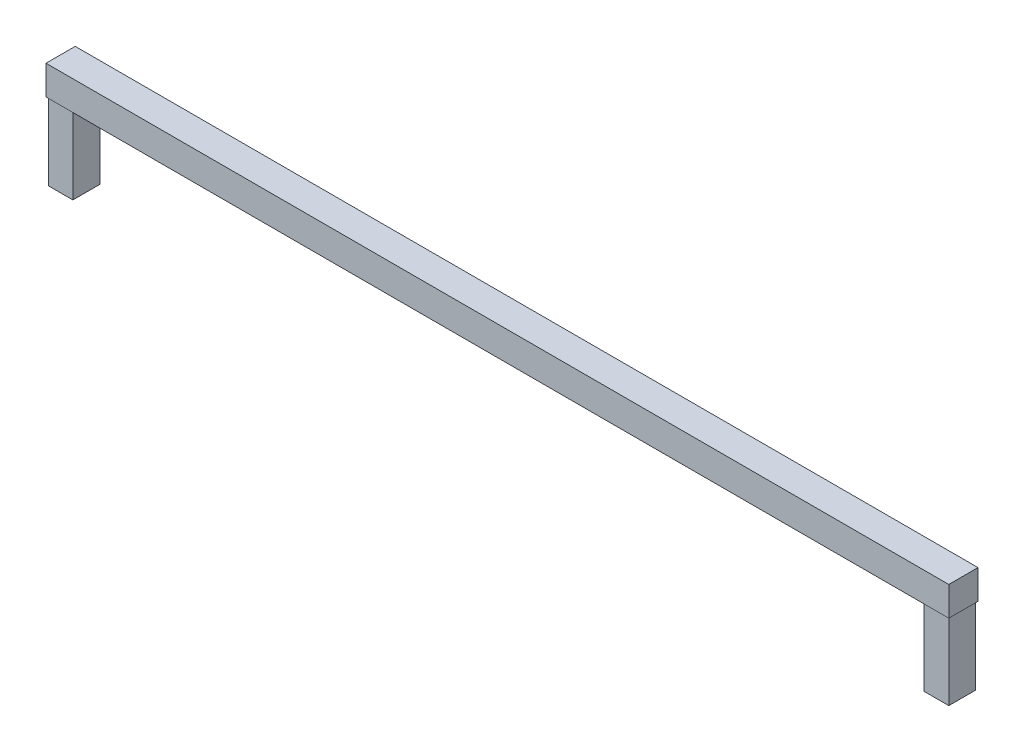
ISO-10303-21;
HEADER;
FILE_DESCRIPTION(('STEP AP214'),'2;1');
FILE_NAME('part.step','',(''),(''),'','','');
FILE_SCHEMA(('AUTOMOTIVE_DESIGN { 1 0 10303 214 1 1 1 1 }'));
ENDSEC;
DATA;
#1=APPLICATION_CONTEXT('core data for automotive mechanical design processes');
#2=APPLICATION_PROTOCOL_DEFINITION('international standard','automotive_design',2000,#1);
#3=PRODUCT_CONTEXT('',#1,'mechanical');
#4=PRODUCT('Part','Part','',(#3));
#5=PRODUCT_RELATED_PRODUCT_CATEGORY('part','',(#4));
#6=PRODUCT_DEFINITION_FORMATION('','',#4);
#7=PRODUCT_DEFINITION_CONTEXT('part definition',#1,'design');
#8=PRODUCT_DEFINITION('design','',#6,#7);
#9=PRODUCT_DEFINITION_SHAPE('','',#8);
#10=(LENGTH_UNIT() NAMED_UNIT(*) SI_UNIT(.MILLI.,.METRE.));
#11=(NAMED_UNIT(*) PLANE_ANGLE_UNIT() SI_UNIT($,.RADIAN.));
#12=(NAMED_UNIT(*) SI_UNIT($,.STERADIAN.) SOLID_ANGLE_UNIT());
#13=UNCERTAINTY_MEASURE_WITH_UNIT(LENGTH_MEASURE(1.E-05),#10,'distance_accuracy_value','');
#14=(GEOMETRIC_REPRESENTATION_CONTEXT(3) GLOBAL_UNCERTAINTY_ASSIGNED_CONTEXT((#13)) GLOBAL_UNIT_ASSIGNED_CONTEXT((#10,
#11,#12)) REPRESENTATION_CONTEXT('',''));
#15=CARTESIAN_POINT('',(0.,0.,0.));
#16=DIRECTION('',(0.,0.,1.));
#17=DIRECTION('',(1.,0.,0.));
#18=AXIS2_PLACEMENT_3D('',#15,#16,#17);
#19=CARTESIAN_POINT('',(0.,0.,38.));
#20=DIRECTION('',(0.,-1.,0.));
#21=DIRECTION('',(1.,0.,0.));
#22=AXIS2_PLACEMENT_3D('',#19,#20,#21);
#23=PLANE('',#22);
#24=DIRECTION('',(-1.,0.,0.));
#25=VECTOR('',#24,1.);
#26=CARTESIAN_POINT('',(0.,0.,0.));
#27=LINE('',#26,#25);
#28=CARTESIAN_POINT('',(587.,0.,0.));
#29=VERTEX_POINT('',#28);
#30=CARTESIAN_POINT('',(-587.,0.,0.));
#31=VERTEX_POINT('',#30);
#32=EDGE_CURVE('E85',#29,#31,#27,.T.);
#33=ORIENTED_EDGE('',*,*,#32,.F.);
#34=DIRECTION('',(0.,0.,-1.));
#35=VECTOR('',#34,1.);
#36=CARTESIAN_POINT('',(587.,0.,38.));
#37=LINE('',#36,#35);
#38=CARTESIAN_POINT('',(587.,0.,38.));
#39=VERTEX_POINT('',#38);
#40=EDGE_CURVE('E165',#39,#29,#37,.T.);
#41=ORIENTED_EDGE('',*,*,#40,.F.);
#42=DIRECTION('',(-1.,0.,0.));
#43=VECTOR('',#42,1.);
#44=CARTESIAN_POINT('',(0.,0.,38.));
#45=LINE('',#44,#43);
#46=CARTESIAN_POINT('',(-587.,0.,38.));
#47=VERTEX_POINT('',#46);
#48=EDGE_CURVE('E88',#39,#47,#45,.T.);
#49=ORIENTED_EDGE('',*,*,#48,.T.);
#50=DIRECTION('',(0.,0.,-1.));
#51=VECTOR('',#50,1.);
#52=CARTESIAN_POINT('',(-587.,0.,38.));
#53=LINE('',#52,#51);
#54=EDGE_CURVE('E54',#47,#31,#53,.T.);
#55=ORIENTED_EDGE('',*,*,#54,.T.);
#56=EDGE_LOOP('',(#33,#41,#49,#55));
#57=FACE_BOUND('',#56,.T.);
#58=DIRECTION('',(-1.,0.,0.));
#59=VECTOR('',#58,1.);
#60=CARTESIAN_POINT('',(-553.55,0.,36.5000000000001));
#61=LINE('',#60,#59);
#62=CARTESIAN_POINT('',(-553.55,0.,36.5000000000001));
#63=VERTEX_POINT('',#62);
#64=CARTESIAN_POINT('',(-585.5,0.,36.5000000000001));
#65=VERTEX_POINT('',#64);
#66=EDGE_CURVE('E139',#63,#65,#61,.T.);
#67=ORIENTED_EDGE('',*,*,#66,.F.);
#68=DIRECTION('',(0.,0.,1.));
#69=VECTOR('',#68,1.);
#70=CARTESIAN_POINT('',(-553.55,0.,1.50000000000007));
#71=LINE('',#70,#69);
#72=CARTESIAN_POINT('',(-553.55,0.,1.50000000000007));
#73=VERTEX_POINT('',#72);
#74=EDGE_CURVE('E143',#73,#63,#71,.T.);
#75=ORIENTED_EDGE('',*,*,#74,.F.);
#76=DIRECTION('',(1.,0.,0.));
#77=VECTOR('',#76,1.);
#78=CARTESIAN_POINT('',(-553.55,0.,1.50000000000007));
#79=LINE('',#78,#77);
#80=CARTESIAN_POINT('',(-585.5,0.,1.50000000000007));
#81=VERTEX_POINT('',#80);
#82=EDGE_CURVE('E132',#81,#73,#79,.T.);
#83=ORIENTED_EDGE('',*,*,#82,.F.);
#84=DIRECTION('',(0.,0.,-1.));
#85=VECTOR('',#84,1.);
#86=CARTESIAN_POINT('',(-585.5,0.,1.50000000000007));
#87=LINE('',#86,#85);
#88=EDGE_CURVE('E136',#65,#81,#87,.T.);
#89=ORIENTED_EDGE('',*,*,#88,.F.);
#90=EDGE_LOOP('',(#67,#75,#83,#89));
#91=FACE_BOUND('',#90,.T.);
#92=DIRECTION('',(1.,0.,0.));
#93=VECTOR('',#92,1.);
#94=CARTESIAN_POINT('',(553.55,1.35580647133604E-13,36.5000000000001));
#95=LINE('',#94,#93);
#96=CARTESIAN_POINT('',(553.55,1.35580647133604E-13,36.5000000000001));
#97=VERTEX_POINT('',#96);
#98=CARTESIAN_POINT('',(585.5,1.43406140180155E-13,36.5000000000001));
#99=VERTEX_POINT('',#98);
#100=EDGE_CURVE('E200',#97,#99,#95,.T.);
#101=ORIENTED_EDGE('',*,*,#100,.T.);
#102=DIRECTION('',(0.,0.,-1.));
#103=VECTOR('',#102,1.);
#104=CARTESIAN_POINT('',(585.5,1.43406140180155E-13,1.50000000000007));
#105=LINE('',#104,#103);
#106=CARTESIAN_POINT('',(585.5,0.,1.50000000000007));
#107=VERTEX_POINT('',#106);
#108=EDGE_CURVE('E196',#99,#107,#105,.T.);
#109=ORIENTED_EDGE('',*,*,#108,.T.);
#110=DIRECTION('',(-1.,0.,0.));
#111=VECTOR('',#110,1.);
#112=CARTESIAN_POINT('',(553.55,1.35580647133604E-13,1.50000000000007));
#113=LINE('',#112,#111);
#114=CARTESIAN_POINT('',(553.55,1.35580647133604E-13,1.50000000000007));
#115=VERTEX_POINT('',#114);
#116=EDGE_CURVE('E191',#107,#115,#113,.T.);
#117=ORIENTED_EDGE('',*,*,#116,.T.);
#118=DIRECTION('',(0.,0.,1.));
#119=VECTOR('',#118,1.);
#120=CARTESIAN_POINT('',(553.55,1.35580647133604E-13,1.50000000000007));
#121=LINE('',#120,#119);
#122=EDGE_CURVE('E204',#115,#97,#121,.T.);
#123=ORIENTED_EDGE('',*,*,#122,.T.);
#124=EDGE_LOOP('',(#101,#109,#117,#123));
#125=FACE_BOUND('',#124,.T.);
#126=ADVANCED_FACE('F45',(#57,#91,#125),#23,.T.);
#127=CARTESIAN_POINT('',(0.,38.,38.));
#128=DIRECTION('',(0.,-1.,0.));
#129=DIRECTION('',(1.,0.,0.));
#130=AXIS2_PLACEMENT_3D('',#127,#128,#129);
#131=PLANE('',#130);
#132=DIRECTION('',(-1.,0.,0.));
#133=VECTOR('',#132,1.);
#134=CARTESIAN_POINT('',(0.,38.,0.));
#135=LINE('',#134,#133);
#136=CARTESIAN_POINT('',(587.,38.0000000000001,0.));
#137=VERTEX_POINT('',#136);
#138=CARTESIAN_POINT('',(-587.,37.9999999999999,0.));
#139=VERTEX_POINT('',#138);
#140=EDGE_CURVE('E98',#137,#139,#135,.T.);
#141=ORIENTED_EDGE('',*,*,#140,.T.);
#142=DIRECTION('',(0.,0.,-1.));
#143=VECTOR('',#142,1.);
#144=CARTESIAN_POINT('',(-587.,37.9999999999999,38.));
#145=LINE('',#144,#143);
#146=CARTESIAN_POINT('',(-587.,37.9999999999999,38.));
#147=VERTEX_POINT('',#146);
#148=EDGE_CURVE('E11',#147,#139,#145,.T.);
#149=ORIENTED_EDGE('',*,*,#148,.F.);
#150=DIRECTION('',(-1.,0.,0.));
#151=VECTOR('',#150,1.);
#152=CARTESIAN_POINT('',(0.,38.,38.));
#153=LINE('',#152,#151);
#154=CARTESIAN_POINT('',(587.,38.0000000000001,38.));
#155=VERTEX_POINT('',#154);
#156=EDGE_CURVE('E105',#155,#147,#153,.T.);
#157=ORIENTED_EDGE('',*,*,#156,.F.);
#158=DIRECTION('',(0.,0.,-1.));
#159=VECTOR('',#158,1.);
#160=CARTESIAN_POINT('',(587.,38.0000000000001,38.));
#161=LINE('',#160,#159);
#162=EDGE_CURVE('E147',#155,#137,#161,.T.);
#163=ORIENTED_EDGE('',*,*,#162,.T.);
#164=EDGE_LOOP('',(#141,#149,#157,#163));
#165=FACE_BOUND('',#164,.T.);
#166=ADVANCED_FACE('F47',(#165),#131,.F.);
#167=CARTESIAN_POINT('',(-587.,0.,38.));
#168=DIRECTION('',(-1.,0.,0.));
#169=DIRECTION('',(0.,0.,1.));
#170=AXIS2_PLACEMENT_3D('',#167,#168,#169);
#171=PLANE('',#170);
#172=DIRECTION('',(0.,1.,0.));
#173=VECTOR('',#172,1.);
#174=CARTESIAN_POINT('',(-587.,0.,0.));
#175=LINE('',#174,#173);
#176=EDGE_CURVE('E91',#31,#139,#175,.T.);
#177=ORIENTED_EDGE('',*,*,#176,.F.);
#178=ORIENTED_EDGE('',*,*,#54,.F.);
#179=DIRECTION('',(0.,1.,0.));
#180=VECTOR('',#179,1.);
#181=CARTESIAN_POINT('',(-587.,0.,38.));
#182=LINE('',#181,#180);
#183=EDGE_CURVE('E108',#47,#147,#182,.T.);
#184=ORIENTED_EDGE('',*,*,#183,.T.);
#185=ORIENTED_EDGE('',*,*,#148,.T.);
#186=EDGE_LOOP('',(#177,#178,#184,#185));
#187=FACE_BOUND('',#186,.T.);
#188=ADVANCED_FACE('F92',(#187),#171,.T.);
#189=CARTESIAN_POINT('',(0.,0.,38.));
#190=DIRECTION('',(0.,0.,-1.));
#191=DIRECTION('',(-1.,0.,0.));
#192=AXIS2_PLACEMENT_3D('',#189,#190,#191);
#193=PLANE('',#192);
#194=ORIENTED_EDGE('',*,*,#156,.T.);
#195=ORIENTED_EDGE('',*,*,#183,.F.);
#196=ORIENTED_EDGE('',*,*,#48,.F.);
#197=DIRECTION('',(0.,1.,0.));
#198=VECTOR('',#197,1.);
#199=CARTESIAN_POINT('',(587.,0.,38.));
#200=LINE('',#199,#198);
#201=EDGE_CURVE('E168',#39,#155,#200,.T.);
#202=ORIENTED_EDGE('',*,*,#201,.T.);
#203=EDGE_LOOP('',(#194,#195,#196,#202));
#204=FACE_BOUND('',#203,.T.);
#205=ADVANCED_FACE('F311',(#204),#193,.F.);
#206=CARTESIAN_POINT('',(0.,0.,0.));
#207=DIRECTION('',(0.,0.,-1.));
#208=DIRECTION('',(-1.,0.,0.));
#209=AXIS2_PLACEMENT_3D('',#206,#207,#208);
#210=PLANE('',#209);
#211=ORIENTED_EDGE('',*,*,#140,.F.);
#212=DIRECTION('',(0.,1.,0.));
#213=VECTOR('',#212,1.);
#214=CARTESIAN_POINT('',(587.,0.,0.));
#215=LINE('',#214,#213);
#216=EDGE_CURVE('E102',#29,#137,#215,.T.);
#217=ORIENTED_EDGE('',*,*,#216,.F.);
#218=ORIENTED_EDGE('',*,*,#32,.T.);
#219=ORIENTED_EDGE('',*,*,#176,.T.);
#220=EDGE_LOOP('',(#211,#217,#218,#219));
#221=FACE_BOUND('',#220,.T.);
#222=ADVANCED_FACE('F100',(#221),#210,.T.);
#223=CARTESIAN_POINT('',(-553.55,-100.,1.50000000000007));
#224=DIRECTION('',(-1.,0.,0.));
#225=DIRECTION('',(0.,0.,1.));
#226=AXIS2_PLACEMENT_3D('',#223,#224,#225);
#227=PLANE('',#226);
#228=ORIENTED_EDGE('',*,*,#74,.T.);
#229=DIRECTION('',(0.,1.,0.));
#230=VECTOR('',#229,1.);
#231=CARTESIAN_POINT('',(-553.55,-100.,36.5000000000001));
#232=LINE('',#231,#230);
#233=CARTESIAN_POINT('',(-553.55,-100.,36.5000000000001));
#234=VERTEX_POINT('',#233);
#235=EDGE_CURVE('E113',#234,#63,#232,.T.);
#236=ORIENTED_EDGE('',*,*,#235,.F.);
#237=DIRECTION('',(0.,0.,1.));
#238=VECTOR('',#237,1.);
#239=CARTESIAN_POINT('',(-553.55,-100.,1.50000000000007));
#240=LINE('',#239,#238);
#241=CARTESIAN_POINT('',(-553.55,-100.,1.50000000000007));
#242=VERTEX_POINT('',#241);
#243=EDGE_CURVE('E135',#242,#234,#240,.T.);
#244=ORIENTED_EDGE('',*,*,#243,.F.);
#245=DIRECTION('',(0.,1.,0.));
#246=VECTOR('',#245,1.);
#247=CARTESIAN_POINT('',(-553.55,-100.,1.50000000000007));
#248=LINE('',#247,#246);
#249=EDGE_CURVE('E127',#242,#73,#248,.T.);
#250=ORIENTED_EDGE('',*,*,#249,.T.);
#251=EDGE_LOOP('',(#228,#236,#244,#250));
#252=FACE_BOUND('',#251,.T.);
#253=ADVANCED_FACE('F278',(#252),#227,.F.);
#254=CARTESIAN_POINT('',(-553.55,-100.,36.5000000000001));
#255=DIRECTION('',(0.,0.,-1.));
#256=DIRECTION('',(-1.,0.,0.));
#257=AXIS2_PLACEMENT_3D('',#254,#255,#256);
#258=PLANE('',#257);
#259=ORIENTED_EDGE('',*,*,#66,.T.);
#260=DIRECTION('',(0.,1.,0.));
#261=VECTOR('',#260,1.);
#262=CARTESIAN_POINT('',(-585.5,-100.,36.5000000000001));
#263=LINE('',#262,#261);
#264=CARTESIAN_POINT('',(-585.5,-100.,36.5000000000001));
#265=VERTEX_POINT('',#264);
#266=EDGE_CURVE('E121',#265,#65,#263,.T.);
#267=ORIENTED_EDGE('',*,*,#266,.F.);
#268=DIRECTION('',(-1.,0.,0.));
#269=VECTOR('',#268,1.);
#270=CARTESIAN_POINT('',(-553.55,-100.,36.5000000000001));
#271=LINE('',#270,#269);
#272=EDGE_CURVE('E155',#234,#265,#271,.T.);
#273=ORIENTED_EDGE('',*,*,#272,.F.);
#274=ORIENTED_EDGE('',*,*,#235,.T.);
#275=EDGE_LOOP('',(#259,#267,#273,#274));
#276=FACE_BOUND('',#275,.T.);
#277=ADVANCED_FACE('F284',(#276),#258,.F.);
#278=CARTESIAN_POINT('',(-585.5,-100.,1.50000000000007));
#279=DIRECTION('',(1.,0.,0.));
#280=DIRECTION('',(0.,0.,-1.));
#281=AXIS2_PLACEMENT_3D('',#278,#279,#280);
#282=PLANE('',#281);
#283=ORIENTED_EDGE('',*,*,#88,.T.);
#284=DIRECTION('',(0.,1.,0.));
#285=VECTOR('',#284,1.);
#286=CARTESIAN_POINT('',(-585.5,-100.,1.50000000000007));
#287=LINE('',#286,#285);
#288=CARTESIAN_POINT('',(-585.5,-100.,1.50000000000007));
#289=VERTEX_POINT('',#288);
#290=EDGE_CURVE('E61',#289,#81,#287,.T.);
#291=ORIENTED_EDGE('',*,*,#290,.F.);
#292=DIRECTION('',(0.,0.,-1.));
#293=VECTOR('',#292,1.);
#294=CARTESIAN_POINT('',(-585.5,-100.,1.50000000000007));
#295=LINE('',#294,#293);
#296=EDGE_CURVE('E151',#265,#289,#295,.T.);
#297=ORIENTED_EDGE('',*,*,#296,.F.);
#298=ORIENTED_EDGE('',*,*,#266,.T.);
#299=EDGE_LOOP('',(#283,#291,#297,#298));
#300=FACE_BOUND('',#299,.T.);
#301=ADVANCED_FACE('F287',(#300),#282,.F.);
#302=CARTESIAN_POINT('',(-553.55,-100.,1.50000000000007));
#303=DIRECTION('',(0.,0.,1.));
#304=DIRECTION('',(1.,0.,0.));
#305=AXIS2_PLACEMENT_3D('',#302,#303,#304);
#306=PLANE('',#305);
#307=ORIENTED_EDGE('',*,*,#82,.T.);
#308=ORIENTED_EDGE('',*,*,#249,.F.);
#309=DIRECTION('',(1.,0.,0.));
#310=VECTOR('',#309,1.);
#311=CARTESIAN_POINT('',(-553.55,-100.,1.50000000000007));
#312=LINE('',#311,#310);
#313=EDGE_CURVE('E131',#289,#242,#312,.T.);
#314=ORIENTED_EDGE('',*,*,#313,.F.);
#315=ORIENTED_EDGE('',*,*,#290,.T.);
#316=EDGE_LOOP('',(#307,#308,#314,#315));
#317=FACE_BOUND('',#316,.T.);
#318=ADVANCED_FACE('F273',(#317),#306,.F.);
#319=CARTESIAN_POINT('',(0.,-100.,0.));
#320=DIRECTION('',(0.,-1.,0.));
#321=DIRECTION('',(0.,0.,-1.));
#322=AXIS2_PLACEMENT_3D('',#319,#320,#321);
#323=PLANE('',#322);
#324=ORIENTED_EDGE('',*,*,#243,.T.);
#325=ORIENTED_EDGE('',*,*,#272,.T.);
#326=ORIENTED_EDGE('',*,*,#296,.T.);
#327=ORIENTED_EDGE('',*,*,#313,.T.);
#328=EDGE_LOOP('',(#324,#325,#326,#327));
#329=FACE_BOUND('',#328,.T.);
#330=ADVANCED_FACE('F289',(#329),#323,.T.);
#331=CARTESIAN_POINT('',(587.,0.,38.));
#332=DIRECTION('',(1.,0.,0.));
#333=DIRECTION('',(0.,0.,1.));
#334=AXIS2_PLACEMENT_3D('',#331,#332,#333);
#335=PLANE('',#334);
#336=ORIENTED_EDGE('',*,*,#216,.T.);
#337=ORIENTED_EDGE('',*,*,#162,.F.);
#338=ORIENTED_EDGE('',*,*,#201,.F.);
#339=ORIENTED_EDGE('',*,*,#40,.T.);
#340=EDGE_LOOP('',(#336,#337,#338,#339));
#341=FACE_BOUND('',#340,.T.);
#342=ADVANCED_FACE('F291',(#341),#335,.T.);
#343=CARTESIAN_POINT('',(553.55,-99.9999999999999,1.50000000000007));
#344=DIRECTION('',(1.,0.,0.));
#345=DIRECTION('',(0.,0.,1.));
#346=AXIS2_PLACEMENT_3D('',#343,#344,#345);
#347=PLANE('',#346);
#348=ORIENTED_EDGE('',*,*,#122,.F.);
#349=DIRECTION('',(0.,1.,0.));
#350=VECTOR('',#349,1.);
#351=CARTESIAN_POINT('',(553.55,-99.9999999999999,1.50000000000007));
#352=LINE('',#351,#350);
#353=CARTESIAN_POINT('',(553.55,-99.9999999999999,1.50000000000007));
#354=VERTEX_POINT('',#353);
#355=EDGE_CURVE('E186',#354,#115,#352,.T.);
#356=ORIENTED_EDGE('',*,*,#355,.F.);
#357=DIRECTION('',(0.,0.,1.));
#358=VECTOR('',#357,1.);
#359=CARTESIAN_POINT('',(553.55,-99.9999999999999,1.50000000000007));
#360=LINE('',#359,#358);
#361=CARTESIAN_POINT('',(553.55,-99.9999999999999,36.5000000000001));
#362=VERTEX_POINT('',#361);
#363=EDGE_CURVE('E195',#354,#362,#360,.T.);
#364=ORIENTED_EDGE('',*,*,#363,.T.);
#365=DIRECTION('',(0.,1.,0.));
#366=VECTOR('',#365,1.);
#367=CARTESIAN_POINT('',(553.55,-99.9999999999999,36.5000000000001));
#368=LINE('',#367,#366);
#369=EDGE_CURVE('E171',#362,#97,#368,.T.);
#370=ORIENTED_EDGE('',*,*,#369,.T.);
#371=EDGE_LOOP('',(#348,#356,#364,#370));
#372=FACE_BOUND('',#371,.T.);
#373=ADVANCED_FACE('F226',(#372),#347,.F.);
#374=CARTESIAN_POINT('',(553.55,-99.9999999999999,36.5000000000001));
#375=DIRECTION('',(0.,0.,-1.));
#376=DIRECTION('',(1.,0.,0.));
#377=AXIS2_PLACEMENT_3D('',#374,#375,#376);
#378=PLANE('',#377);
#379=ORIENTED_EDGE('',*,*,#100,.F.);
#380=ORIENTED_EDGE('',*,*,#369,.F.);
#381=DIRECTION('',(1.,0.,0.));
#382=VECTOR('',#381,1.);
#383=CARTESIAN_POINT('',(553.55,-99.9999999999999,36.5000000000001));
#384=LINE('',#383,#382);
#385=CARTESIAN_POINT('',(585.5,-99.9999999999999,36.5000000000001));
#386=VERTEX_POINT('',#385);
#387=EDGE_CURVE('E215',#362,#386,#384,.T.);
#388=ORIENTED_EDGE('',*,*,#387,.T.);
#389=DIRECTION('',(0.,1.,0.));
#390=VECTOR('',#389,1.);
#391=CARTESIAN_POINT('',(585.5,-99.9999999999999,36.5000000000001));
#392=LINE('',#391,#390);
#393=EDGE_CURVE('E178',#386,#99,#392,.T.);
#394=ORIENTED_EDGE('',*,*,#393,.T.);
#395=EDGE_LOOP('',(#379,#380,#388,#394));
#396=FACE_BOUND('',#395,.T.);
#397=ADVANCED_FACE('F377',(#396),#378,.F.);
#398=CARTESIAN_POINT('',(585.5,-99.9999999999999,1.50000000000007));
#399=DIRECTION('',(-1.,0.,0.));
#400=DIRECTION('',(0.,0.,-1.));
#401=AXIS2_PLACEMENT_3D('',#398,#399,#400);
#402=PLANE('',#401);
#403=ORIENTED_EDGE('',*,*,#108,.F.);
#404=ORIENTED_EDGE('',*,*,#393,.F.);
#405=DIRECTION('',(0.,0.,-1.));
#406=VECTOR('',#405,1.);
#407=CARTESIAN_POINT('',(585.5,-99.9999999999999,1.50000000000007));
#408=LINE('',#407,#406);
#409=CARTESIAN_POINT('',(585.5,-99.9999999999999,1.50000000000007));
#410=VERTEX_POINT('',#409);
#411=EDGE_CURVE('E211',#386,#410,#408,.T.);
#412=ORIENTED_EDGE('',*,*,#411,.T.);
#413=DIRECTION('',(0.,1.,0.));
#414=VECTOR('',#413,1.);
#415=CARTESIAN_POINT('',(585.5,-99.9999999999999,1.50000000000007));
#416=LINE('',#415,#414);
#417=EDGE_CURVE('E182',#410,#107,#416,.T.);
#418=ORIENTED_EDGE('',*,*,#417,.T.);
#419=EDGE_LOOP('',(#403,#404,#412,#418));
#420=FACE_BOUND('',#419,.T.);
#421=ADVANCED_FACE('F386',(#420),#402,.F.);
#422=CARTESIAN_POINT('',(553.55,-99.9999999999999,1.50000000000007));
#423=DIRECTION('',(0.,0.,1.));
#424=DIRECTION('',(-1.,0.,0.));
#425=AXIS2_PLACEMENT_3D('',#422,#423,#424);
#426=PLANE('',#425);
#427=ORIENTED_EDGE('',*,*,#116,.F.);
#428=ORIENTED_EDGE('',*,*,#417,.F.);
#429=DIRECTION('',(-1.,0.,0.));
#430=VECTOR('',#429,1.);
#431=CARTESIAN_POINT('',(553.55,-99.9999999999999,1.50000000000007));
#432=LINE('',#431,#430);
#433=EDGE_CURVE('E190',#410,#354,#432,.T.);
#434=ORIENTED_EDGE('',*,*,#433,.T.);
#435=ORIENTED_EDGE('',*,*,#355,.T.);
#436=EDGE_LOOP('',(#427,#428,#434,#435));
#437=FACE_BOUND('',#436,.T.);
#438=ADVANCED_FACE('F396',(#437),#426,.F.);
#439=CARTESIAN_POINT('',(0.,-100.,0.));
#440=DIRECTION('',(0.,-1.,0.));
#441=DIRECTION('',(0.,0.,-1.));
#442=AXIS2_PLACEMENT_3D('',#439,#440,#441);
#443=PLANE('',#442);
#444=ORIENTED_EDGE('',*,*,#363,.F.);
#445=ORIENTED_EDGE('',*,*,#433,.F.);
#446=ORIENTED_EDGE('',*,*,#411,.F.);
#447=ORIENTED_EDGE('',*,*,#387,.F.);
#448=EDGE_LOOP('',(#444,#445,#446,#447));
#449=FACE_BOUND('',#448,.T.);
#450=ADVANCED_FACE('F236',(#449),#443,.T.);
#451=CLOSED_SHELL('',(#126,#166,#188,#205,#222,#253,#277,#301,#318,#330,#342,#373,#397,#421,
#438,#450));
#452=MANIFOLD_SOLID_BREP('B2',#451);
#453=ADVANCED_BREP_SHAPE_REPRESENTATION('',(#18,#452),#14);
#454=SHAPE_DEFINITION_REPRESENTATION(#9,#453);
ENDSEC;
END-ISO-10303-21;
